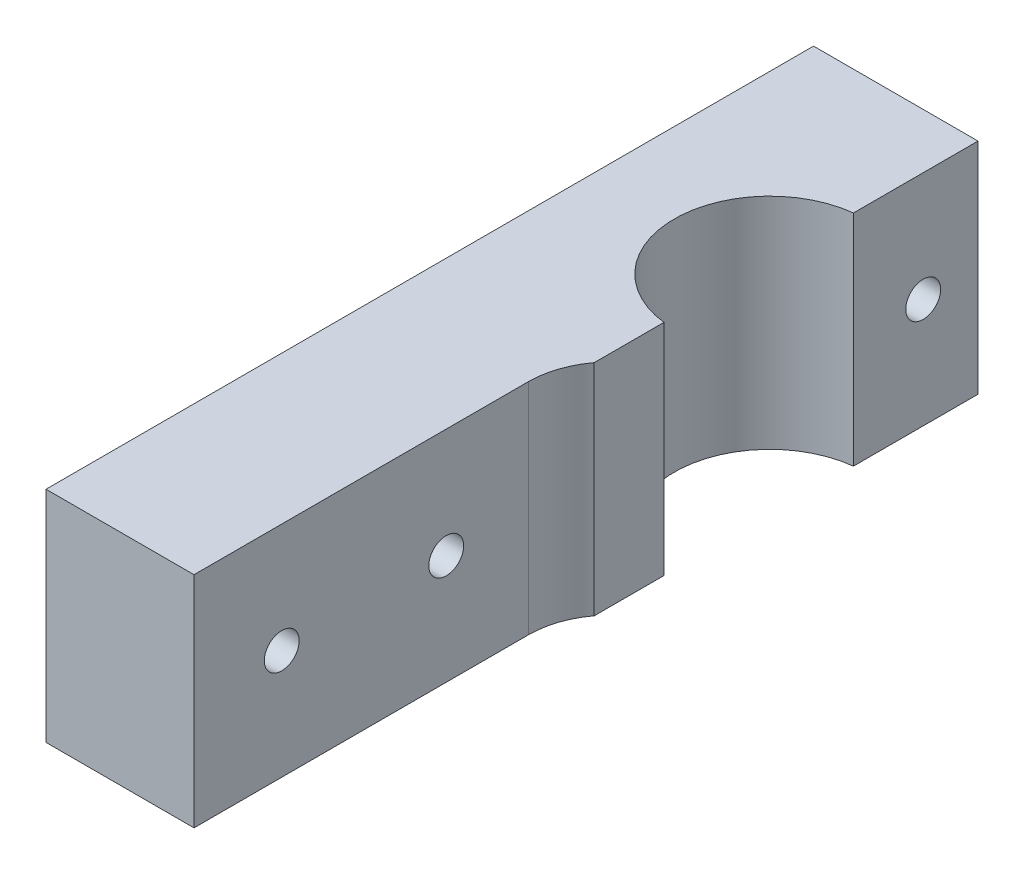
ISO-10303-21;
HEADER;
FILE_DESCRIPTION(('STEP AP214'),'2;1');
FILE_NAME('part.step','',(''),(''),'','','');
FILE_SCHEMA(('AUTOMOTIVE_DESIGN { 1 0 10303 214 1 1 1 1 }'));
ENDSEC;
DATA;
#1=APPLICATION_CONTEXT('core data for automotive mechanical design processes');
#2=APPLICATION_PROTOCOL_DEFINITION('international standard','automotive_design',2000,#1);
#3=PRODUCT_CONTEXT('',#1,'mechanical');
#4=PRODUCT('Part','Part','',(#3));
#5=PRODUCT_RELATED_PRODUCT_CATEGORY('part','',(#4));
#6=PRODUCT_DEFINITION_FORMATION('','',#4);
#7=PRODUCT_DEFINITION_CONTEXT('part definition',#1,'design');
#8=PRODUCT_DEFINITION('design','',#6,#7);
#9=PRODUCT_DEFINITION_SHAPE('','',#8);
#10=(LENGTH_UNIT() NAMED_UNIT(*) SI_UNIT(.MILLI.,.METRE.));
#11=(NAMED_UNIT(*) PLANE_ANGLE_UNIT() SI_UNIT($,.RADIAN.));
#12=(NAMED_UNIT(*) SI_UNIT($,.STERADIAN.) SOLID_ANGLE_UNIT());
#13=UNCERTAINTY_MEASURE_WITH_UNIT(LENGTH_MEASURE(1.E-05),#10,'distance_accuracy_value','');
#14=(GEOMETRIC_REPRESENTATION_CONTEXT(3) GLOBAL_UNCERTAINTY_ASSIGNED_CONTEXT((#13)) GLOBAL_UNIT_ASSIGNED_CONTEXT((#10,
#11,#12)) REPRESENTATION_CONTEXT('',''));
#15=CARTESIAN_POINT('',(0.,0.,0.));
#16=DIRECTION('',(0.,0.,1.));
#17=DIRECTION('',(1.,0.,0.));
#18=AXIS2_PLACEMENT_3D('',#15,#16,#17);
#19=CARTESIAN_POINT('',(-1.27000000000001,12.7,-25.4));
#20=DIRECTION('',(0.,0.,0.999999999999999));
#21=DIRECTION('',(0.999999999999999,0.,0.));
#22=AXIS2_PLACEMENT_3D('',#19,#20,#21);
#23=PLANE('',#22);
#24=DIRECTION('',(-0.999999999999999,0.,0.));
#25=VECTOR('',#24,1.);
#26=CARTESIAN_POINT('',(-1.27,-12.7,-25.4));
#27=LINE('',#26,#25);
#28=CARTESIAN_POINT('',(-1.27,-12.7,-25.4));
#29=VERTEX_POINT('',#28);
#30=CARTESIAN_POINT('',(-20.32,-12.7,-25.4));
#31=VERTEX_POINT('',#30);
#32=EDGE_CURVE('E148',#29,#31,#27,.T.);
#33=ORIENTED_EDGE('',*,*,#32,.T.);
#34=DIRECTION('',(0.,-1.,0.));
#35=VECTOR('',#34,1.);
#36=CARTESIAN_POINT('',(-20.32,12.7,-25.4));
#37=LINE('',#36,#35);
#38=CARTESIAN_POINT('',(-20.32,12.7,-25.4));
#39=VERTEX_POINT('',#38);
#40=EDGE_CURVE('E189',#39,#31,#37,.T.);
#41=ORIENTED_EDGE('',*,*,#40,.F.);
#42=DIRECTION('',(-0.999999999999999,0.,0.));
#43=VECTOR('',#42,1.);
#44=CARTESIAN_POINT('',(-1.27000000000001,12.7,-25.4));
#45=LINE('',#44,#43);
#46=CARTESIAN_POINT('',(-1.27000000000001,12.7,-25.4));
#47=VERTEX_POINT('',#46);
#48=EDGE_CURVE('E150',#47,#39,#45,.T.);
#49=ORIENTED_EDGE('',*,*,#48,.F.);
#50=DIRECTION('',(0.,-1.,0.));
#51=VECTOR('',#50,1.);
#52=CARTESIAN_POINT('',(-1.27000000000001,12.7,-25.4));
#53=LINE('',#52,#51);
#54=EDGE_CURVE('E165',#47,#29,#53,.T.);
#55=ORIENTED_EDGE('',*,*,#54,.T.);
#56=EDGE_LOOP('',(#33,#41,#49,#55));
#57=FACE_BOUND('',#56,.T.);
#58=ADVANCED_FACE('F42',(#57),#23,.F.);
#59=CARTESIAN_POINT('',(-20.32,12.7,-25.4));
#60=DIRECTION('',(0.999999999999999,0.,0.));
#61=DIRECTION('',(0.,0.,-0.999999999999999));
#62=AXIS2_PLACEMENT_3D('',#59,#60,#61);
#63=PLANE('',#62);
#64=DIRECTION('',(0.,0.,0.999999999999999));
#65=VECTOR('',#64,1.);
#66=CARTESIAN_POINT('',(-20.32,-12.7,-25.4));
#67=LINE('',#66,#65);
#68=CARTESIAN_POINT('',(-20.32,-12.7,63.4999999999999));
#69=VERTEX_POINT('',#68);
#70=EDGE_CURVE('E168',#31,#69,#67,.T.);
#71=ORIENTED_EDGE('',*,*,#70,.T.);
#72=DIRECTION('',(0.,-1.,0.));
#73=VECTOR('',#72,1.);
#74=CARTESIAN_POINT('',(-20.32,12.6999999999999,63.4999999999999));
#75=LINE('',#74,#73);
#76=CARTESIAN_POINT('',(-20.32,12.6999999999999,63.4999999999999));
#77=VERTEX_POINT('',#76);
#78=EDGE_CURVE('E186',#77,#69,#75,.T.);
#79=ORIENTED_EDGE('',*,*,#78,.F.);
#80=DIRECTION('',(0.,0.,0.999999999999999));
#81=VECTOR('',#80,1.);
#82=CARTESIAN_POINT('',(-20.32,12.7,-25.4));
#83=LINE('',#82,#81);
#84=EDGE_CURVE('E153',#39,#77,#83,.T.);
#85=ORIENTED_EDGE('',*,*,#84,.F.);
#86=ORIENTED_EDGE('',*,*,#40,.T.);
#87=EDGE_LOOP('',(#71,#79,#85,#86));
#88=FACE_BOUND('',#87,.T.);
#89=ADVANCED_FACE('F212',(#88),#63,.F.);
#90=CARTESIAN_POINT('',(-1.27,12.7,63.4999999999999));
#91=DIRECTION('',(0.,0.,-0.999999999999999));
#92=DIRECTION('',(-0.999999999999999,0.,0.));
#93=AXIS2_PLACEMENT_3D('',#90,#91,#92);
#94=PLANE('',#93);
#95=DIRECTION('',(0.999999999999999,0.,0.));
#96=VECTOR('',#95,1.);
#97=CARTESIAN_POINT('',(-1.26999999999999,-12.7,63.4999999999999));
#98=LINE('',#97,#96);
#99=CARTESIAN_POINT('',(-3.175,-12.7,63.4999999999999));
#100=VERTEX_POINT('',#99);
#101=EDGE_CURVE('E170',#69,#100,#98,.T.);
#102=ORIENTED_EDGE('',*,*,#101,.T.);
#103=DIRECTION('',(0.,1.,0.));
#104=VECTOR('',#103,1.);
#105=CARTESIAN_POINT('',(-3.175,-12.7,63.4999999999999));
#106=LINE('',#105,#104);
#107=CARTESIAN_POINT('',(-3.17499999999999,12.7,63.4999999999999));
#108=VERTEX_POINT('',#107);
#109=EDGE_CURVE('E145',#100,#108,#106,.T.);
#110=ORIENTED_EDGE('',*,*,#109,.T.);
#111=DIRECTION('',(0.999999999999999,0.,0.));
#112=VECTOR('',#111,1.);
#113=CARTESIAN_POINT('',(-1.27,12.7,63.4999999999999));
#114=LINE('',#113,#112);
#115=EDGE_CURVE('E156',#77,#108,#114,.T.);
#116=ORIENTED_EDGE('',*,*,#115,.F.);
#117=ORIENTED_EDGE('',*,*,#78,.T.);
#118=EDGE_LOOP('',(#102,#110,#116,#117));
#119=FACE_BOUND('',#118,.T.);
#120=ADVANCED_FACE('F208',(#119),#94,.F.);
#121=CARTESIAN_POINT('',(-1.27,12.7,10.9757688113407));
#122=DIRECTION('',(-0.999999999999999,0.,0.));
#123=DIRECTION('',(0.,0.,0.999999999999999));
#124=AXIS2_PLACEMENT_3D('',#121,#122,#123);
#125=PLANE('',#124);
#126=DIRECTION('',(0.,0.,-0.999999999999999));
#127=VECTOR('',#126,1.);
#128=CARTESIAN_POINT('',(-1.27,12.7,10.9757688113407));
#129=LINE('',#128,#127);
#130=CARTESIAN_POINT('',(-1.26999999999999,12.7,19.05));
#131=VERTEX_POINT('',#130);
#132=CARTESIAN_POINT('',(-1.27,12.7,10.9757688113407));
#133=VERTEX_POINT('',#132);
#134=EDGE_CURVE('E159',#131,#133,#129,.T.);
#135=ORIENTED_EDGE('',*,*,#134,.F.);
#136=DIRECTION('',(0.,1.,0.));
#137=VECTOR('',#136,1.);
#138=CARTESIAN_POINT('',(-1.26999999999999,-12.7,19.05));
#139=LINE('',#138,#137);
#140=CARTESIAN_POINT('',(-1.26999999999999,-12.7,19.05));
#141=VERTEX_POINT('',#140);
#142=EDGE_CURVE('E143',#141,#131,#139,.T.);
#143=ORIENTED_EDGE('',*,*,#142,.F.);
#144=DIRECTION('',(0.,0.,-0.999999999999999));
#145=VECTOR('',#144,1.);
#146=CARTESIAN_POINT('',(-1.27,-12.7,10.9757688113407));
#147=LINE('',#146,#145);
#148=CARTESIAN_POINT('',(-1.27,-12.7,10.9757688113407));
#149=VERTEX_POINT('',#148);
#150=EDGE_CURVE('E173',#141,#149,#147,.T.);
#151=ORIENTED_EDGE('',*,*,#150,.T.);
#152=DIRECTION('',(0.,-1.,0.));
#153=VECTOR('',#152,1.);
#154=CARTESIAN_POINT('',(-1.27,12.7,10.9757688113407));
#155=LINE('',#154,#153);
#156=EDGE_CURVE('E183',#133,#149,#155,.T.);
#157=ORIENTED_EDGE('',*,*,#156,.F.);
#158=EDGE_LOOP('',(#135,#143,#151,#157));
#159=FACE_BOUND('',#158,.T.);
#160=ADVANCED_FACE('F199',(#159),#125,.F.);
#161=CARTESIAN_POINT('',(0.,12.7,0.));
#162=DIRECTION('',(0.,-1.,0.));
#163=DIRECTION('',(0.,0.,-0.999999999999999));
#164=AXIS2_PLACEMENT_3D('',#161,#162,#163);
#165=CYLINDRICAL_SURFACE('',#164,11.049);
#166=CARTESIAN_POINT('',(0.,-12.7,0.));
#167=DIRECTION('',(0.,-1.,0.));
#168=DIRECTION('',(0.,0.,0.999999999999999));
#169=AXIS2_PLACEMENT_3D('',#166,#167,#168);
#170=CIRCLE('',#169,11.049);
#171=CARTESIAN_POINT('',(-1.27000000000001,-12.7,-10.9757688113407));
#172=VERTEX_POINT('',#171);
#173=EDGE_CURVE('E175',#149,#172,#170,.T.);
#174=ORIENTED_EDGE('',*,*,#173,.T.);
#175=DIRECTION('',(0.,-1.,0.));
#176=VECTOR('',#175,1.);
#177=CARTESIAN_POINT('',(-1.27,12.7,-10.9757688113407));
#178=LINE('',#177,#176);
#179=CARTESIAN_POINT('',(-1.27,12.7,-10.9757688113407));
#180=VERTEX_POINT('',#179);
#181=EDGE_CURVE('E180',#180,#172,#178,.T.);
#182=ORIENTED_EDGE('',*,*,#181,.F.);
#183=CARTESIAN_POINT('',(0.,12.7,0.));
#184=DIRECTION('',(0.,-1.,0.));
#185=DIRECTION('',(0.,0.,0.999999999999999));
#186=AXIS2_PLACEMENT_3D('',#183,#184,#185);
#187=CIRCLE('',#186,11.049);
#188=EDGE_CURVE('E161',#133,#180,#187,.T.);
#189=ORIENTED_EDGE('',*,*,#188,.F.);
#190=ORIENTED_EDGE('',*,*,#156,.T.);
#191=EDGE_LOOP('',(#174,#182,#189,#190));
#192=FACE_BOUND('',#191,.T.);
#193=ADVANCED_FACE('F224',(#192),#165,.F.);
#194=CARTESIAN_POINT('',(-1.27,12.7,-10.9757688113407));
#195=DIRECTION('',(-0.999999999999999,0.,0.));
#196=DIRECTION('',(0.,0.,0.999999999999999));
#197=AXIS2_PLACEMENT_3D('',#194,#195,#196);
#198=PLANE('',#197);
#199=CARTESIAN_POINT('',(-1.27,0.,-19.05));
#200=DIRECTION('',(0.999999999999999,0.,0.));
#201=DIRECTION('',(0.,0.,-0.999999999999999));
#202=AXIS2_PLACEMENT_3D('',#199,#200,#201);
#203=CIRCLE('',#202,2.01929999999999);
#204=CARTESIAN_POINT('',(-1.27,0.,-21.0693));
#205=VERTEX_POINT('',#204);
#206=EDGE_CURVE('E124',#205,#205,#203,.T.);
#207=ORIENTED_EDGE('',*,*,#206,.F.);
#208=EDGE_LOOP('',(#207));
#209=FACE_BOUND('',#208,.T.);
#210=DIRECTION('',(0.,0.,-0.999999999999999));
#211=VECTOR('',#210,1.);
#212=CARTESIAN_POINT('',(-1.27000000000001,-12.7,-10.9757688113407));
#213=LINE('',#212,#211);
#214=EDGE_CURVE('E154',#172,#29,#213,.T.);
#215=ORIENTED_EDGE('',*,*,#214,.T.);
#216=ORIENTED_EDGE('',*,*,#54,.F.);
#217=DIRECTION('',(0.,0.,-0.999999999999999));
#218=VECTOR('',#217,1.);
#219=CARTESIAN_POINT('',(-1.27,12.7,-10.9757688113407));
#220=LINE('',#219,#218);
#221=EDGE_CURVE('E163',#180,#47,#220,.T.);
#222=ORIENTED_EDGE('',*,*,#221,.F.);
#223=ORIENTED_EDGE('',*,*,#181,.T.);
#224=EDGE_LOOP('',(#215,#216,#222,#223));
#225=FACE_BOUND('',#224,.T.);
#226=ADVANCED_FACE('F220',(#209,#225),#198,.F.);
#227=CARTESIAN_POINT('',(0.,12.7,0.));
#228=DIRECTION('',(0.,1.,0.));
#229=DIRECTION('',(0.,0.,0.999999999999999));
#230=AXIS2_PLACEMENT_3D('',#227,#228,#229);
#231=PLANE('',#230);
#232=DIRECTION('',(0.,0.,0.999999999999999));
#233=VECTOR('',#232,1.);
#234=CARTESIAN_POINT('',(-3.17499999999999,12.7,63.4999999999999));
#235=LINE('',#234,#233);
#236=CARTESIAN_POINT('',(-3.175,12.7,24.765));
#237=VERTEX_POINT('',#236);
#238=EDGE_CURVE('E140',#237,#108,#235,.T.);
#239=ORIENTED_EDGE('',*,*,#238,.F.);
#240=CARTESIAN_POINT('',(6.34999999999999,12.7,24.765));
#241=DIRECTION('',(0.,1.,0.));
#242=DIRECTION('',(0.,0.,0.999999999999999));
#243=AXIS2_PLACEMENT_3D('',#240,#241,#242);
#244=CIRCLE('',#243,9.525);
#245=EDGE_CURVE('E50',#237,#131,#244,.F.);
#246=ORIENTED_EDGE('',*,*,#245,.T.);
#247=ORIENTED_EDGE('',*,*,#134,.T.);
#248=ORIENTED_EDGE('',*,*,#188,.T.);
#249=ORIENTED_EDGE('',*,*,#221,.T.);
#250=ORIENTED_EDGE('',*,*,#48,.T.);
#251=ORIENTED_EDGE('',*,*,#84,.T.);
#252=ORIENTED_EDGE('',*,*,#115,.T.);
#253=EDGE_LOOP('',(#239,#246,#247,#248,#249,#250,#251,#252));
#254=FACE_BOUND('',#253,.T.);
#255=ADVANCED_FACE('F196',(#254),#231,.T.);
#256=CARTESIAN_POINT('',(0.,-12.7,0.));
#257=DIRECTION('',(0.,1.,0.));
#258=DIRECTION('',(0.,0.,0.999999999999999));
#259=AXIS2_PLACEMENT_3D('',#256,#257,#258);
#260=PLANE('',#259);
#261=ORIENTED_EDGE('',*,*,#150,.F.);
#262=CARTESIAN_POINT('',(6.35000000000001,-12.7,24.765));
#263=DIRECTION('',(0.,1.,0.));
#264=DIRECTION('',(0.,0.,0.999999999999999));
#265=AXIS2_PLACEMENT_3D('',#262,#263,#264);
#266=CIRCLE('',#265,9.525);
#267=CARTESIAN_POINT('',(-3.175,-12.7,24.765));
#268=VERTEX_POINT('',#267);
#269=EDGE_CURVE('E11',#141,#268,#266,.T.);
#270=ORIENTED_EDGE('',*,*,#269,.T.);
#271=DIRECTION('',(0.,0.,0.999999999999999));
#272=VECTOR('',#271,1.);
#273=CARTESIAN_POINT('',(-3.175,-12.7,63.4999999999999));
#274=LINE('',#273,#272);
#275=EDGE_CURVE('E141',#268,#100,#274,.T.);
#276=ORIENTED_EDGE('',*,*,#275,.T.);
#277=ORIENTED_EDGE('',*,*,#101,.F.);
#278=ORIENTED_EDGE('',*,*,#70,.F.);
#279=ORIENTED_EDGE('',*,*,#32,.F.);
#280=ORIENTED_EDGE('',*,*,#214,.F.);
#281=ORIENTED_EDGE('',*,*,#173,.F.);
#282=EDGE_LOOP('',(#261,#270,#276,#277,#278,#279,#280,#281));
#283=FACE_BOUND('',#282,.T.);
#284=ADVANCED_FACE('F205',(#283),#260,.F.);
#285=CARTESIAN_POINT('',(-3.175,-12.7,63.4999999999999));
#286=DIRECTION('',(-0.999999999999999,0.,0.));
#287=DIRECTION('',(0.,0.,0.999999999999999));
#288=AXIS2_PLACEMENT_3D('',#285,#286,#287);
#289=PLANE('',#288);
#290=CARTESIAN_POINT('',(-3.175,0.,53.34));
#291=DIRECTION('',(0.999999999999999,0.,0.));
#292=DIRECTION('',(0.,0.,-0.999999999999999));
#293=AXIS2_PLACEMENT_3D('',#290,#291,#292);
#294=CIRCLE('',#293,2.01929999999994);
#295=CARTESIAN_POINT('',(-3.175,0.,51.3207));
#296=VERTEX_POINT('',#295);
#297=EDGE_CURVE('E123',#296,#296,#294,.T.);
#298=ORIENTED_EDGE('',*,*,#297,.F.);
#299=EDGE_LOOP('',(#298));
#300=FACE_BOUND('',#299,.T.);
#301=CARTESIAN_POINT('',(-3.17499999999999,0.,34.2899999999999));
#302=DIRECTION('',(0.999999999999999,0.,0.));
#303=DIRECTION('',(0.,0.,-0.999999999999999));
#304=AXIS2_PLACEMENT_3D('',#301,#302,#303);
#305=CIRCLE('',#304,2.01929999999994);
#306=CARTESIAN_POINT('',(-3.17499999999999,0.,32.2707));
#307=VERTEX_POINT('',#306);
#308=EDGE_CURVE('E134',#307,#307,#305,.T.);
#309=ORIENTED_EDGE('',*,*,#308,.F.);
#310=EDGE_LOOP('',(#309));
#311=FACE_BOUND('',#310,.T.);
#312=ORIENTED_EDGE('',*,*,#275,.F.);
#313=DIRECTION('',(0.,1.,0.));
#314=VECTOR('',#313,1.);
#315=CARTESIAN_POINT('',(-3.175,-12.7,24.765));
#316=LINE('',#315,#314);
#317=EDGE_CURVE('E192',#268,#237,#316,.T.);
#318=ORIENTED_EDGE('',*,*,#317,.T.);
#319=ORIENTED_EDGE('',*,*,#238,.T.);
#320=ORIENTED_EDGE('',*,*,#109,.F.);
#321=EDGE_LOOP('',(#312,#318,#319,#320));
#322=FACE_BOUND('',#321,.T.);
#323=ADVANCED_FACE('F202',(#300,#311,#322),#289,.F.);
#324=CARTESIAN_POINT('',(6.35000000000001,-12.7,24.765));
#325=DIRECTION('',(0.,1.,0.));
#326=DIRECTION('',(0.,0.,0.999999999999999));
#327=AXIS2_PLACEMENT_3D('',#324,#325,#326);
#328=CYLINDRICAL_SURFACE('',#327,9.525);
#329=ORIENTED_EDGE('',*,*,#269,.F.);
#330=ORIENTED_EDGE('',*,*,#142,.T.);
#331=ORIENTED_EDGE('',*,*,#245,.F.);
#332=ORIENTED_EDGE('',*,*,#317,.F.);
#333=EDGE_LOOP('',(#329,#330,#331,#332));
#334=FACE_BOUND('',#333,.T.);
#335=ADVANCED_FACE('F44',(#334),#328,.F.);
#336=CARTESIAN_POINT('',(-17.653,0.,34.2899999999999));
#337=DIRECTION('',(0.999999999999999,0.,0.));
#338=DIRECTION('',(0.,0.,-0.999999999999999));
#339=AXIS2_PLACEMENT_3D('',#336,#337,#338);
#340=CONICAL_SURFACE('',#339,2.0193,1.02974425867665);
#341=CARTESIAN_POINT('',(-18.8663178480023,0.,34.2899999999999));
#342=VERTEX_POINT('',#341);
#343=VERTEX_LOOP('',#342);
#344=FACE_BOUND('',#343,.T.);
#345=CARTESIAN_POINT('',(-17.653,0.,34.2899999999999));
#346=DIRECTION('',(0.999999999999999,0.,0.));
#347=DIRECTION('',(0.,0.,-0.999999999999999));
#348=AXIS2_PLACEMENT_3D('',#345,#346,#347);
#349=CIRCLE('',#348,2.0193);
#350=CARTESIAN_POINT('',(-17.653,0.,32.2707));
#351=VERTEX_POINT('',#350);
#352=EDGE_CURVE('E137',#351,#351,#349,.T.);
#353=ORIENTED_EDGE('',*,*,#352,.T.);
#354=EDGE_LOOP('',(#353));
#355=FACE_BOUND('',#354,.T.);
#356=ADVANCED_FACE('F281',(#344,#355),#340,.F.);
#357=CARTESIAN_POINT('',(-3.17499999999999,0.,34.2899999999999));
#358=DIRECTION('',(0.999999999999999,0.,0.));
#359=DIRECTION('',(0.,0.,-0.999999999999999));
#360=AXIS2_PLACEMENT_3D('',#357,#358,#359);
#361=CYLINDRICAL_SURFACE('',#360,2.01929999999997);
#362=CARTESIAN_POINT('',(-17.653,0.,32.2707));
#363=CARTESIAN_POINT('',(-17.5021875,0.,32.2707));
#364=CARTESIAN_POINT('',(-17.351375,0.,32.2707));
#365=CARTESIAN_POINT('',(-17.04975,0.,32.2707));
#366=CARTESIAN_POINT('',(-16.8989375,0.,32.2707));
#367=CARTESIAN_POINT('',(-16.5973125,0.,32.2707));
#368=CARTESIAN_POINT('',(-16.4465,0.,32.2707));
#369=CARTESIAN_POINT('',(-16.144875,0.,32.2707));
#370=CARTESIAN_POINT('',(-15.9940625,0.,32.2707));
#371=CARTESIAN_POINT('',(-15.6924375,0.,32.2707));
#372=CARTESIAN_POINT('',(-15.541625,0.,32.2707));
#373=CARTESIAN_POINT('',(-15.24,0.,32.2707));
#374=CARTESIAN_POINT('',(-15.0891875,0.,32.2707));
#375=CARTESIAN_POINT('',(-14.7875625,0.,32.2707));
#376=CARTESIAN_POINT('',(-14.63675,0.,32.2707));
#377=CARTESIAN_POINT('',(-14.335125,0.,32.2707));
#378=CARTESIAN_POINT('',(-14.1843125,0.,32.2707));
#379=CARTESIAN_POINT('',(-13.8826875,0.,32.2707));
#380=CARTESIAN_POINT('',(-13.731875,0.,32.2707));
#381=CARTESIAN_POINT('',(-13.43025,0.,32.2707));
#382=CARTESIAN_POINT('',(-13.2794375,0.,32.2707));
#383=CARTESIAN_POINT('',(-12.9778125,0.,32.2707));
#384=CARTESIAN_POINT('',(-12.827,0.,32.2707));
#385=CARTESIAN_POINT('',(-12.525375,0.,32.2707));
#386=CARTESIAN_POINT('',(-12.3745625,0.,32.2707));
#387=CARTESIAN_POINT('',(-12.0729375,0.,32.2707));
#388=CARTESIAN_POINT('',(-11.922125,0.,32.2707));
#389=CARTESIAN_POINT('',(-11.6205,0.,32.2707));
#390=CARTESIAN_POINT('',(-11.4696875,0.,32.2707));
#391=CARTESIAN_POINT('',(-11.1680625,0.,32.2707));
#392=CARTESIAN_POINT('',(-11.01725,0.,32.2707));
#393=CARTESIAN_POINT('',(-10.715625,0.,32.2707));
#394=CARTESIAN_POINT('',(-10.5648125,0.,32.2707));
#395=CARTESIAN_POINT('',(-10.2631875,0.,32.2707));
#396=CARTESIAN_POINT('',(-10.112375,0.,32.2707));
#397=CARTESIAN_POINT('',(-9.81074999999997,0.,32.2707));
#398=CARTESIAN_POINT('',(-9.65993749999997,0.,32.2707));
#399=CARTESIAN_POINT('',(-9.35831249999997,0.,32.2707));
#400=CARTESIAN_POINT('',(-9.20749999999998,0.,32.2707));
#401=CARTESIAN_POINT('',(-8.90587499999998,0.,32.2707));
#402=CARTESIAN_POINT('',(-8.75506249999998,0.,32.2707));
#403=CARTESIAN_POINT('',(-8.45343749999998,0.,32.2707));
#404=CARTESIAN_POINT('',(-8.30262499999998,0.,32.2707));
#405=CARTESIAN_POINT('',(-8.00099999999998,0.,32.2707));
#406=CARTESIAN_POINT('',(-7.85018749999998,0.,32.2707));
#407=CARTESIAN_POINT('',(-7.54856249999998,0.,32.2707));
#408=CARTESIAN_POINT('',(-7.39774999999998,0.,32.2707));
#409=CARTESIAN_POINT('',(-7.09612499999998,0.,32.2707));
#410=CARTESIAN_POINT('',(-6.94531249999998,0.,32.2707));
#411=CARTESIAN_POINT('',(-6.64368749999998,0.,32.2707));
#412=CARTESIAN_POINT('',(-6.49287499999998,0.,32.2707));
#413=CARTESIAN_POINT('',(-6.19124999999998,0.,32.2707));
#414=CARTESIAN_POINT('',(-6.04043749999998,0.,32.2707));
#415=CARTESIAN_POINT('',(-5.73881249999998,0.,32.2707));
#416=CARTESIAN_POINT('',(-5.58799999999998,0.,32.2707));
#417=CARTESIAN_POINT('',(-5.28637499999999,0.,32.2707));
#418=CARTESIAN_POINT('',(-5.13556249999999,0.,32.2707));
#419=CARTESIAN_POINT('',(-4.83393749999999,0.,32.2707));
#420=CARTESIAN_POINT('',(-4.68312499999999,0.,32.2707));
#421=CARTESIAN_POINT('',(-4.38149999999999,0.,32.2707));
#422=CARTESIAN_POINT('',(-4.23068749999999,0.,32.2707));
#423=CARTESIAN_POINT('',(-3.92906249999999,0.,32.2707));
#424=CARTESIAN_POINT('',(-3.77824999999999,0.,32.2707));
#425=CARTESIAN_POINT('',(-3.47662499999999,0.,32.2707));
#426=CARTESIAN_POINT('',(-3.32581249999999,0.,32.2707));
#427=CARTESIAN_POINT('',(-3.17499999999999,0.,32.2707));
#428=B_SPLINE_CURVE_WITH_KNOTS('',3,(#362,#363,#364,#365,#366,#367,#368,#369,#370,#371,#372,
#373,#374,#375,#376,#377,#378,#379,#380,#381,#382,#383,#384,#385,#386,#387,#388,#389,#390,#391,
#392,#393,#394,#395,#396,#397,#398,#399,#400,#401,#402,#403,#404,#405,#406,#407,#408,#409,#410,
#411,#412,#413,#414,#415,#416,#417,#418,#419,#420,#421,#422,#423,#424,#425,#426,#427),
.UNSPECIFIED.,.F.,.F.,(4,2,2,2,2,2,2,2,2,2,2,2,2,2,2,2,2,2,2,2,2,2,2,2,2,2,2,2,2,2,2,2,4),(0.,
0.4524375,0.904874999999999,1.3573125,1.80975,2.2621875,2.71462499999999,3.16706249999999,
3.61949999999999,4.07193749999999,4.52437499999999,4.97681249999999,5.42924999999999,
5.88168749999999,6.33412499999999,6.78656249999999,7.23899999999998,7.69143749999998,
8.14387499999998,8.59631249999998,9.04874999999998,9.50118749999998,9.95362499999998,10.4060625,
10.8585,11.3109375,11.763375,12.2158125,12.66825,13.1206875,13.573125,14.0255625,14.478),.UNSPECIFIED.);
#429=EDGE_CURVE('BSEAM287',#351,#307,#428,.T.);
#430=ORIENTED_EDGE('',*,*,#352,.F.);
#431=ORIENTED_EDGE('',*,*,#308,.T.);
#432=ORIENTED_EDGE('',*,*,#429,.T.);
#433=ORIENTED_EDGE('',*,*,#429,.F.);
#434=EDGE_LOOP('',(#430,#432,#431,#433));
#435=FACE_BOUND('',#434,.T.);
#436=ADVANCED_FACE('F287',(#435),#361,.F.);
#437=CARTESIAN_POINT('',(-17.653,0.,53.34));
#438=DIRECTION('',(0.999999999999999,0.,0.));
#439=DIRECTION('',(0.,0.,-0.999999999999999));
#440=AXIS2_PLACEMENT_3D('',#437,#438,#439);
#441=CONICAL_SURFACE('',#440,2.0193,1.02974425867665);
#442=CARTESIAN_POINT('',(-18.8663178480023,0.,53.34));
#443=VERTEX_POINT('',#442);
#444=VERTEX_LOOP('',#443);
#445=FACE_BOUND('',#444,.T.);
#446=CARTESIAN_POINT('',(-17.653,0.,53.34));
#447=DIRECTION('',(0.999999999999999,0.,0.));
#448=DIRECTION('',(0.,0.,-0.999999999999999));
#449=AXIS2_PLACEMENT_3D('',#446,#447,#448);
#450=CIRCLE('',#449,2.0193);
#451=CARTESIAN_POINT('',(-17.653,0.,51.3207));
#452=VERTEX_POINT('',#451);
#453=EDGE_CURVE('E127',#452,#452,#450,.T.);
#454=ORIENTED_EDGE('',*,*,#453,.T.);
#455=EDGE_LOOP('',(#454));
#456=FACE_BOUND('',#455,.T.);
#457=ADVANCED_FACE('F296',(#445,#456),#441,.F.);
#458=CARTESIAN_POINT('',(-3.175,0.,53.34));
#459=DIRECTION('',(0.999999999999999,0.,0.));
#460=DIRECTION('',(0.,0.,-0.999999999999999));
#461=AXIS2_PLACEMENT_3D('',#458,#459,#460);
#462=CYLINDRICAL_SURFACE('',#461,2.01929999999997);
#463=CARTESIAN_POINT('',(-17.653,0.,51.3207));
#464=CARTESIAN_POINT('',(-17.5021875,0.,51.3207));
#465=CARTESIAN_POINT('',(-17.351375,0.,51.3207));
#466=CARTESIAN_POINT('',(-17.04975,0.,51.3207));
#467=CARTESIAN_POINT('',(-16.8989375,0.,51.3207));
#468=CARTESIAN_POINT('',(-16.5973125,0.,51.3207));
#469=CARTESIAN_POINT('',(-16.4465,0.,51.3207));
#470=CARTESIAN_POINT('',(-16.144875,0.,51.3207));
#471=CARTESIAN_POINT('',(-15.9940625,0.,51.3207));
#472=CARTESIAN_POINT('',(-15.6924375,0.,51.3207));
#473=CARTESIAN_POINT('',(-15.541625,0.,51.3207));
#474=CARTESIAN_POINT('',(-15.24,0.,51.3207));
#475=CARTESIAN_POINT('',(-15.0891875,0.,51.3207));
#476=CARTESIAN_POINT('',(-14.7875625,0.,51.3207));
#477=CARTESIAN_POINT('',(-14.63675,0.,51.3207));
#478=CARTESIAN_POINT('',(-14.335125,0.,51.3207));
#479=CARTESIAN_POINT('',(-14.1843125,0.,51.3207));
#480=CARTESIAN_POINT('',(-13.8826875,0.,51.3207));
#481=CARTESIAN_POINT('',(-13.731875,0.,51.3207));
#482=CARTESIAN_POINT('',(-13.43025,0.,51.3207));
#483=CARTESIAN_POINT('',(-13.2794375,0.,51.3207));
#484=CARTESIAN_POINT('',(-12.9778125,0.,51.3207));
#485=CARTESIAN_POINT('',(-12.827,0.,51.3207));
#486=CARTESIAN_POINT('',(-12.525375,0.,51.3207));
#487=CARTESIAN_POINT('',(-12.3745625,0.,51.3207));
#488=CARTESIAN_POINT('',(-12.0729375,0.,51.3207));
#489=CARTESIAN_POINT('',(-11.922125,0.,51.3207));
#490=CARTESIAN_POINT('',(-11.6205,0.,51.3207));
#491=CARTESIAN_POINT('',(-11.4696875,0.,51.3207));
#492=CARTESIAN_POINT('',(-11.1680625,0.,51.3207));
#493=CARTESIAN_POINT('',(-11.01725,0.,51.3207));
#494=CARTESIAN_POINT('',(-10.715625,0.,51.3207));
#495=CARTESIAN_POINT('',(-10.5648125,0.,51.3207));
#496=CARTESIAN_POINT('',(-10.2631875,0.,51.3207));
#497=CARTESIAN_POINT('',(-10.112375,0.,51.3207));
#498=CARTESIAN_POINT('',(-9.81075,0.,51.3207));
#499=CARTESIAN_POINT('',(-9.6599375,0.,51.3207));
#500=CARTESIAN_POINT('',(-9.3583125,0.,51.3207));
#501=CARTESIAN_POINT('',(-9.2075,0.,51.3207));
#502=CARTESIAN_POINT('',(-8.905875,0.,51.3207));
#503=CARTESIAN_POINT('',(-8.7550625,0.,51.3207));
#504=CARTESIAN_POINT('',(-8.4534375,0.,51.3207));
#505=CARTESIAN_POINT('',(-8.302625,0.,51.3207));
#506=CARTESIAN_POINT('',(-8.001,0.,51.3207));
#507=CARTESIAN_POINT('',(-7.8501875,0.,51.3207));
#508=CARTESIAN_POINT('',(-7.5485625,0.,51.3207));
#509=CARTESIAN_POINT('',(-7.39775,0.,51.3207));
#510=CARTESIAN_POINT('',(-7.096125,0.,51.3207));
#511=CARTESIAN_POINT('',(-6.9453125,0.,51.3207));
#512=CARTESIAN_POINT('',(-6.6436875,0.,51.3207));
#513=CARTESIAN_POINT('',(-6.492875,0.,51.3207));
#514=CARTESIAN_POINT('',(-6.19125,0.,51.3207));
#515=CARTESIAN_POINT('',(-6.0404375,0.,51.3207));
#516=CARTESIAN_POINT('',(-5.7388125,0.,51.3207));
#517=CARTESIAN_POINT('',(-5.588,0.,51.3207));
#518=CARTESIAN_POINT('',(-5.286375,0.,51.3207));
#519=CARTESIAN_POINT('',(-5.1355625,0.,51.3207));
#520=CARTESIAN_POINT('',(-4.8339375,0.,51.3207));
#521=CARTESIAN_POINT('',(-4.683125,0.,51.3207));
#522=CARTESIAN_POINT('',(-4.3815,0.,51.3207));
#523=CARTESIAN_POINT('',(-4.2306875,0.,51.3207));
#524=CARTESIAN_POINT('',(-3.9290625,0.,51.3207));
#525=CARTESIAN_POINT('',(-3.77825,0.,51.3207));
#526=CARTESIAN_POINT('',(-3.476625,0.,51.3207));
#527=CARTESIAN_POINT('',(-3.3258125,0.,51.3207));
#528=CARTESIAN_POINT('',(-3.175,0.,51.3207));
#529=B_SPLINE_CURVE_WITH_KNOTS('',3,(#463,#464,#465,#466,#467,#468,#469,#470,#471,#472,#473,
#474,#475,#476,#477,#478,#479,#480,#481,#482,#483,#484,#485,#486,#487,#488,#489,#490,#491,#492,
#493,#494,#495,#496,#497,#498,#499,#500,#501,#502,#503,#504,#505,#506,#507,#508,#509,#510,#511,
#512,#513,#514,#515,#516,#517,#518,#519,#520,#521,#522,#523,#524,#525,#526,#527,#528),
.UNSPECIFIED.,.F.,.F.,(4,2,2,2,2,2,2,2,2,2,2,2,2,2,2,2,2,2,2,2,2,2,2,2,2,2,2,2,2,2,2,2,4),(0.,
0.4524375,0.904875000000003,1.3573125,1.80975,2.2621875,2.714625,3.1670625,3.6195,4.0719375,
4.524375,4.9768125,5.42925,5.8816875,6.334125,6.7865625,7.239,7.6914375,8.143875,8.5963125,
9.04875,9.5011875,9.953625,10.4060625,10.8585,11.3109375,11.763375,12.2158125,12.66825,
13.1206875,13.573125,14.0255625,14.478),.UNSPECIFIED.);
#530=EDGE_CURVE('BSEAM117',#452,#296,#529,.T.);
#531=ORIENTED_EDGE('',*,*,#453,.F.);
#532=ORIENTED_EDGE('',*,*,#297,.T.);
#533=ORIENTED_EDGE('',*,*,#530,.T.);
#534=ORIENTED_EDGE('',*,*,#530,.F.);
#535=EDGE_LOOP('',(#531,#533,#532,#534));
#536=FACE_BOUND('',#535,.T.);
#537=ADVANCED_FACE('F117',(#536),#462,.F.);
#538=CARTESIAN_POINT('',(-15.748,0.,-19.05));
#539=DIRECTION('',(0.999999999999999,0.,0.));
#540=DIRECTION('',(0.,0.,-0.999999999999999));
#541=AXIS2_PLACEMENT_3D('',#538,#539,#540);
#542=CONICAL_SURFACE('',#541,2.0193,1.02974425867665);
#543=CARTESIAN_POINT('',(-16.9613178480024,0.,-19.05));
#544=VERTEX_POINT('',#543);
#545=VERTEX_LOOP('',#544);
#546=FACE_BOUND('',#545,.T.);
#547=CARTESIAN_POINT('',(-15.748,0.,-19.05));
#548=DIRECTION('',(0.999999999999999,0.,0.));
#549=DIRECTION('',(0.,0.,-0.999999999999999));
#550=AXIS2_PLACEMENT_3D('',#547,#548,#549);
#551=CIRCLE('',#550,2.0193);
#552=CARTESIAN_POINT('',(-15.748,0.,-21.0693));
#553=VERTEX_POINT('',#552);
#554=EDGE_CURVE('E121',#553,#553,#551,.T.);
#555=ORIENTED_EDGE('',*,*,#554,.T.);
#556=EDGE_LOOP('',(#555));
#557=FACE_BOUND('',#556,.T.);
#558=ADVANCED_FACE('F113',(#546,#557),#542,.F.);
#559=CARTESIAN_POINT('',(-1.27,0.,-19.05));
#560=DIRECTION('',(0.999999999999999,0.,0.));
#561=DIRECTION('',(0.,0.,-0.999999999999999));
#562=AXIS2_PLACEMENT_3D('',#559,#560,#561);
#563=CYLINDRICAL_SURFACE('',#562,2.01929999999999);
#564=CARTESIAN_POINT('',(-15.748,0.,-21.0693));
#565=CARTESIAN_POINT('',(-15.5971875,0.,-21.0693));
#566=CARTESIAN_POINT('',(-15.446375,0.,-21.0693));
#567=CARTESIAN_POINT('',(-15.14475,0.,-21.0693));
#568=CARTESIAN_POINT('',(-14.9939375,0.,-21.0693));
#569=CARTESIAN_POINT('',(-14.6923125,0.,-21.0693));
#570=CARTESIAN_POINT('',(-14.5415,0.,-21.0693));
#571=CARTESIAN_POINT('',(-14.239875,0.,-21.0693));
#572=CARTESIAN_POINT('',(-14.0890625,0.,-21.0693));
#573=CARTESIAN_POINT('',(-13.7874375,0.,-21.0693));
#574=CARTESIAN_POINT('',(-13.636625,0.,-21.0693));
#575=CARTESIAN_POINT('',(-13.335,0.,-21.0693));
#576=CARTESIAN_POINT('',(-13.1841875,0.,-21.0693));
#577=CARTESIAN_POINT('',(-12.8825625,0.,-21.0693));
#578=CARTESIAN_POINT('',(-12.73175,0.,-21.0693));
#579=CARTESIAN_POINT('',(-12.430125,0.,-21.0693));
#580=CARTESIAN_POINT('',(-12.2793125,0.,-21.0693));
#581=CARTESIAN_POINT('',(-11.9776875,0.,-21.0693));
#582=CARTESIAN_POINT('',(-11.826875,0.,-21.0693));
#583=CARTESIAN_POINT('',(-11.52525,0.,-21.0693));
#584=CARTESIAN_POINT('',(-11.3744375,0.,-21.0693));
#585=CARTESIAN_POINT('',(-11.0728125,0.,-21.0693));
#586=CARTESIAN_POINT('',(-10.922,0.,-21.0693));
#587=CARTESIAN_POINT('',(-10.620375,0.,-21.0693));
#588=CARTESIAN_POINT('',(-10.4695625,0.,-21.0693));
#589=CARTESIAN_POINT('',(-10.1679375,0.,-21.0693));
#590=CARTESIAN_POINT('',(-10.017125,0.,-21.0693));
#591=CARTESIAN_POINT('',(-9.71549999999998,0.,-21.0693));
#592=CARTESIAN_POINT('',(-9.56468749999998,0.,-21.0693));
#593=CARTESIAN_POINT('',(-9.26306249999998,0.,-21.0693));
#594=CARTESIAN_POINT('',(-9.11224999999998,0.,-21.0693));
#595=CARTESIAN_POINT('',(-8.81062499999998,0.,-21.0693));
#596=CARTESIAN_POINT('',(-8.65981249999999,0.,-21.0693));
#597=CARTESIAN_POINT('',(-8.35818749999999,0.,-21.0693));
#598=CARTESIAN_POINT('',(-8.20737499999998,0.,-21.0693));
#599=CARTESIAN_POINT('',(-7.90574999999999,0.,-21.0693));
#600=CARTESIAN_POINT('',(-7.75493749999998,0.,-21.0693));
#601=CARTESIAN_POINT('',(-7.45331249999999,0.,-21.0693));
#602=CARTESIAN_POINT('',(-7.30249999999999,0.,-21.0693));
#603=CARTESIAN_POINT('',(-7.00087499999999,0.,-21.0693));
#604=CARTESIAN_POINT('',(-6.85006249999999,0.,-21.0693));
#605=CARTESIAN_POINT('',(-6.54843749999999,0.,-21.0693));
#606=CARTESIAN_POINT('',(-6.39762499999999,0.,-21.0693));
#607=CARTESIAN_POINT('',(-6.09599999999999,0.,-21.0693));
#608=CARTESIAN_POINT('',(-5.94518749999999,0.,-21.0693));
#609=CARTESIAN_POINT('',(-5.64356249999999,0.,-21.0693));
#610=CARTESIAN_POINT('',(-5.49274999999999,0.,-21.0693));
#611=CARTESIAN_POINT('',(-5.19112499999999,0.,-21.0693));
#612=CARTESIAN_POINT('',(-5.04031249999999,0.,-21.0693));
#613=CARTESIAN_POINT('',(-4.73868749999999,0.,-21.0693));
#614=CARTESIAN_POINT('',(-4.58787499999999,0.,-21.0693));
#615=CARTESIAN_POINT('',(-4.28624999999999,0.,-21.0693));
#616=CARTESIAN_POINT('',(-4.13543749999999,0.,-21.0693));
#617=CARTESIAN_POINT('',(-3.83381249999999,0.,-21.0693));
#618=CARTESIAN_POINT('',(-3.683,0.,-21.0693));
#619=CARTESIAN_POINT('',(-3.381375,0.,-21.0693));
#620=CARTESIAN_POINT('',(-3.2305625,0.,-21.0693));
#621=CARTESIAN_POINT('',(-2.9289375,0.,-21.0693));
#622=CARTESIAN_POINT('',(-2.778125,0.,-21.0693));
#623=CARTESIAN_POINT('',(-2.4765,0.,-21.0693));
#624=CARTESIAN_POINT('',(-2.3256875,0.,-21.0693));
#625=CARTESIAN_POINT('',(-2.0240625,0.,-21.0693));
#626=CARTESIAN_POINT('',(-1.87325,0.,-21.0693));
#627=CARTESIAN_POINT('',(-1.571625,0.,-21.0693));
#628=CARTESIAN_POINT('',(-1.4208125,0.,-21.0693));
#629=CARTESIAN_POINT('',(-1.27,0.,-21.0693));
#630=B_SPLINE_CURVE_WITH_KNOTS('',3,(#564,#565,#566,#567,#568,#569,#570,#571,#572,#573,#574,
#575,#576,#577,#578,#579,#580,#581,#582,#583,#584,#585,#586,#587,#588,#589,#590,#591,#592,#593,
#594,#595,#596,#597,#598,#599,#600,#601,#602,#603,#604,#605,#606,#607,#608,#609,#610,#611,#612,
#613,#614,#615,#616,#617,#618,#619,#620,#621,#622,#623,#624,#625,#626,#627,#628,#629),
.UNSPECIFIED.,.F.,.F.,(4,2,2,2,2,2,2,2,2,2,2,2,2,2,2,2,2,2,2,2,2,2,2,2,2,2,2,2,2,2,2,2,4),(0.,
0.4524375,0.904874999999999,1.3573125,1.80975,2.2621875,2.71462499999999,3.16706249999999,
3.61949999999999,4.07193749999999,4.52437499999999,4.97681249999999,5.42924999999999,
5.88168749999999,6.33412499999999,6.78656249999998,7.23899999999998,7.69143749999998,
8.14387499999998,8.59631249999998,9.04874999999998,9.50118749999998,9.95362499999997,10.4060625,
10.8585,11.3109375,11.763375,12.2158125,12.66825,13.1206875,13.573125,14.0255625,14.478),.UNSPECIFIED.);
#631=EDGE_CURVE('BSEAM116',#553,#205,#630,.T.);
#632=ORIENTED_EDGE('',*,*,#554,.F.);
#633=ORIENTED_EDGE('',*,*,#206,.T.);
#634=ORIENTED_EDGE('',*,*,#631,.T.);
#635=ORIENTED_EDGE('',*,*,#631,.F.);
#636=EDGE_LOOP('',(#632,#634,#633,#635));
#637=FACE_BOUND('',#636,.T.);
#638=ADVANCED_FACE('F116',(#637),#563,.F.);
#639=CLOSED_SHELL('',(#58,#89,#120,#160,#193,#226,#255,#284,#323,#335,#356,#436,#457,#537,#558,#638));
#640=MANIFOLD_SOLID_BREP('B2',#639);
#641=ADVANCED_BREP_SHAPE_REPRESENTATION('',(#18,#640),#14);
#642=SHAPE_DEFINITION_REPRESENTATION(#9,#641);
ENDSEC;
END-ISO-10303-21;
